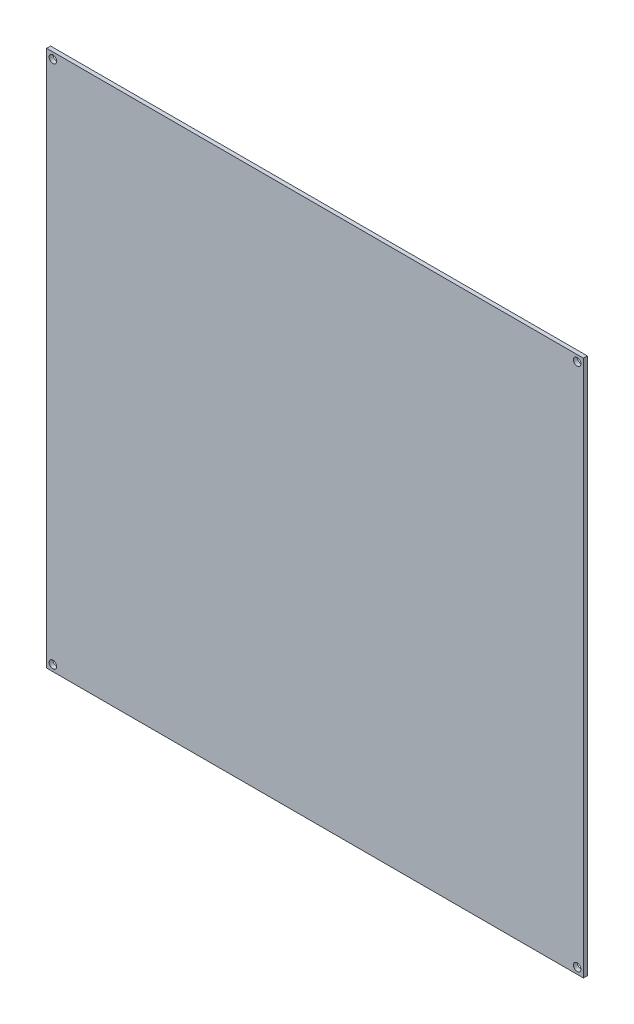
ISO-10303-21;
HEADER;
FILE_DESCRIPTION(('STEP AP214'),'2;1');
FILE_NAME('part.step','',(''),(''),'','','');
FILE_SCHEMA(('AUTOMOTIVE_DESIGN { 1 0 10303 214 1 1 1 1 }'));
ENDSEC;
DATA;
#1=APPLICATION_CONTEXT('core data for automotive mechanical design processes');
#2=APPLICATION_PROTOCOL_DEFINITION('international standard','automotive_design',2000,#1);
#3=PRODUCT_CONTEXT('',#1,'mechanical');
#4=PRODUCT('Part','Part','',(#3));
#5=PRODUCT_RELATED_PRODUCT_CATEGORY('part','',(#4));
#6=PRODUCT_DEFINITION_FORMATION('','',#4);
#7=PRODUCT_DEFINITION_CONTEXT('part definition',#1,'design');
#8=PRODUCT_DEFINITION('design','',#6,#7);
#9=PRODUCT_DEFINITION_SHAPE('','',#8);
#10=(LENGTH_UNIT() NAMED_UNIT(*) SI_UNIT(.MILLI.,.METRE.));
#11=(NAMED_UNIT(*) PLANE_ANGLE_UNIT() SI_UNIT($,.RADIAN.));
#12=(NAMED_UNIT(*) SI_UNIT($,.STERADIAN.) SOLID_ANGLE_UNIT());
#13=UNCERTAINTY_MEASURE_WITH_UNIT(LENGTH_MEASURE(1.E-05),#10,'distance_accuracy_value','');
#14=(GEOMETRIC_REPRESENTATION_CONTEXT(3) GLOBAL_UNCERTAINTY_ASSIGNED_CONTEXT((#13)) GLOBAL_UNIT_ASSIGNED_CONTEXT((#10,
#11,#12)) REPRESENTATION_CONTEXT('',''));
#15=CARTESIAN_POINT('',(0.,0.,0.));
#16=DIRECTION('',(0.,0.,1.));
#17=DIRECTION('',(1.,0.,0.));
#18=AXIS2_PLACEMENT_3D('',#15,#16,#17);
#19=CARTESIAN_POINT('',(0.,0.,1.5748));
#20=DIRECTION('',(0.,0.,1.));
#21=DIRECTION('',(1.,0.,0.));
#22=AXIS2_PLACEMENT_3D('',#19,#20,#21);
#23=PLANE('',#22);
#24=CARTESIAN_POINT('',(104.5,-104.5,1.5748));
#25=DIRECTION('',(0.,0.,1.));
#26=DIRECTION('',(1.,0.,0.));
#27=AXIS2_PLACEMENT_3D('',#24,#25,#26);
#28=CIRCLE('',#27,1.5);
#29=CARTESIAN_POINT('',(106.,-104.5,1.5748));
#30=VERTEX_POINT('',#29);
#31=EDGE_CURVE('E92',#30,#30,#28,.F.);
#32=ORIENTED_EDGE('',*,*,#31,.T.);
#33=EDGE_LOOP('',(#32));
#34=FACE_BOUND('',#33,.T.);
#35=CARTESIAN_POINT('',(-104.5,-104.5,1.5748));
#36=DIRECTION('',(0.,0.,1.));
#37=DIRECTION('',(1.,0.,0.));
#38=AXIS2_PLACEMENT_3D('',#35,#36,#37);
#39=CIRCLE('',#38,1.5);
#40=CARTESIAN_POINT('',(-103.,-104.5,1.5748));
#41=VERTEX_POINT('',#40);
#42=EDGE_CURVE('E95',#41,#41,#39,.F.);
#43=ORIENTED_EDGE('',*,*,#42,.T.);
#44=EDGE_LOOP('',(#43));
#45=FACE_BOUND('',#44,.T.);
#46=CARTESIAN_POINT('',(104.5,104.5,1.5748));
#47=DIRECTION('',(0.,0.,1.));
#48=DIRECTION('',(1.,0.,0.));
#49=AXIS2_PLACEMENT_3D('',#46,#47,#48);
#50=CIRCLE('',#49,1.5);
#51=CARTESIAN_POINT('',(106.,104.5,1.5748));
#52=VERTEX_POINT('',#51);
#53=EDGE_CURVE('E97',#52,#52,#50,.F.);
#54=ORIENTED_EDGE('',*,*,#53,.T.);
#55=EDGE_LOOP('',(#54));
#56=FACE_BOUND('',#55,.T.);
#57=CARTESIAN_POINT('',(-104.5,104.5,1.5748));
#58=DIRECTION('',(0.,0.,1.));
#59=DIRECTION('',(1.,0.,0.));
#60=AXIS2_PLACEMENT_3D('',#57,#58,#59);
#61=CIRCLE('',#60,1.5);
#62=CARTESIAN_POINT('',(-103.,104.5,1.5748));
#63=VERTEX_POINT('',#62);
#64=EDGE_CURVE('E20',#63,#63,#61,.F.);
#65=ORIENTED_EDGE('',*,*,#64,.T.);
#66=EDGE_LOOP('',(#65));
#67=FACE_BOUND('',#66,.T.);
#68=DIRECTION('',(0.,1.,0.));
#69=VECTOR('',#68,1.);
#70=CARTESIAN_POINT('',(-107.,-107.,1.5748));
#71=LINE('',#70,#69);
#72=CARTESIAN_POINT('',(-107.,-107.,1.5748));
#73=VERTEX_POINT('',#72);
#74=CARTESIAN_POINT('',(-107.,107.,1.5748));
#75=VERTEX_POINT('',#74);
#76=EDGE_CURVE('E68',#73,#75,#71,.T.);
#77=ORIENTED_EDGE('',*,*,#76,.F.);
#78=DIRECTION('',(1.,0.,0.));
#79=VECTOR('',#78,1.);
#80=CARTESIAN_POINT('',(107.,-107.,1.5748));
#81=LINE('',#80,#79);
#82=CARTESIAN_POINT('',(107.,-107.,1.5748));
#83=VERTEX_POINT('',#82);
#84=EDGE_CURVE('E59',#83,#73,#81,.F.);
#85=ORIENTED_EDGE('',*,*,#84,.F.);
#86=DIRECTION('',(0.,1.,0.));
#87=VECTOR('',#86,1.);
#88=CARTESIAN_POINT('',(107.,107.,1.5748));
#89=LINE('',#88,#87);
#90=CARTESIAN_POINT('',(107.,107.,1.5748));
#91=VERTEX_POINT('',#90);
#92=EDGE_CURVE('E54',#91,#83,#89,.F.);
#93=ORIENTED_EDGE('',*,*,#92,.F.);
#94=DIRECTION('',(1.,0.,0.));
#95=VECTOR('',#94,1.);
#96=CARTESIAN_POINT('',(-107.,107.,1.5748));
#97=LINE('',#96,#95);
#98=EDGE_CURVE('E71',#75,#91,#97,.T.);
#99=ORIENTED_EDGE('',*,*,#98,.F.);
#100=EDGE_LOOP('',(#77,#85,#93,#99));
#101=FACE_BOUND('',#100,.T.);
#102=ADVANCED_FACE('F17',(#34,#45,#56,#67,#101),#23,.T.);
#103=CARTESIAN_POINT('',(-107.,-107.,0.));
#104=DIRECTION('',(-1.,0.,0.));
#105=DIRECTION('',(0.,0.,1.));
#106=AXIS2_PLACEMENT_3D('',#103,#104,#105);
#107=PLANE('',#106);
#108=DIRECTION('',(0.,1.,0.));
#109=VECTOR('',#108,1.);
#110=CARTESIAN_POINT('',(-107.,0.,0.));
#111=LINE('',#110,#109);
#112=CARTESIAN_POINT('',(-107.,107.,0.));
#113=VERTEX_POINT('',#112);
#114=CARTESIAN_POINT('',(-107.,-107.,0.));
#115=VERTEX_POINT('',#114);
#116=EDGE_CURVE('E78',#113,#115,#111,.F.);
#117=ORIENTED_EDGE('',*,*,#116,.T.);
#118=DIRECTION('',(0.,0.,-1.));
#119=VECTOR('',#118,1.);
#120=CARTESIAN_POINT('',(-107.,-107.,0.));
#121=LINE('',#120,#119);
#122=EDGE_CURVE('E64',#73,#115,#121,.T.);
#123=ORIENTED_EDGE('',*,*,#122,.F.);
#124=ORIENTED_EDGE('',*,*,#76,.T.);
#125=DIRECTION('',(0.,0.,1.));
#126=VECTOR('',#125,1.);
#127=CARTESIAN_POINT('',(-107.,107.,0.));
#128=LINE('',#127,#126);
#129=EDGE_CURVE('E102',#113,#75,#128,.T.);
#130=ORIENTED_EDGE('',*,*,#129,.F.);
#131=EDGE_LOOP('',(#117,#123,#124,#130));
#132=FACE_BOUND('',#131,.T.);
#133=ADVANCED_FACE('F77',(#132),#107,.T.);
#134=CARTESIAN_POINT('',(107.,-107.,0.));
#135=DIRECTION('',(0.,-1.,0.));
#136=DIRECTION('',(0.,0.,-1.));
#137=AXIS2_PLACEMENT_3D('',#134,#135,#136);
#138=PLANE('',#137);
#139=DIRECTION('',(1.,0.,0.));
#140=VECTOR('',#139,1.);
#141=CARTESIAN_POINT('',(0.,-107.,0.));
#142=LINE('',#141,#140);
#143=CARTESIAN_POINT('',(107.,-107.,0.));
#144=VERTEX_POINT('',#143);
#145=EDGE_CURVE('E116',#115,#144,#142,.T.);
#146=ORIENTED_EDGE('',*,*,#145,.T.);
#147=DIRECTION('',(0.,0.,-1.));
#148=VECTOR('',#147,1.);
#149=CARTESIAN_POINT('',(107.,-107.,0.));
#150=LINE('',#149,#148);
#151=EDGE_CURVE('E66',#83,#144,#150,.T.);
#152=ORIENTED_EDGE('',*,*,#151,.F.);
#153=ORIENTED_EDGE('',*,*,#84,.T.);
#154=ORIENTED_EDGE('',*,*,#122,.T.);
#155=EDGE_LOOP('',(#146,#152,#153,#154));
#156=FACE_BOUND('',#155,.T.);
#157=ADVANCED_FACE('F62',(#156),#138,.T.);
#158=CARTESIAN_POINT('',(107.,107.,0.));
#159=DIRECTION('',(1.,0.,0.));
#160=DIRECTION('',(0.,0.,-1.));
#161=AXIS2_PLACEMENT_3D('',#158,#159,#160);
#162=PLANE('',#161);
#163=DIRECTION('',(0.,1.,0.));
#164=VECTOR('',#163,1.);
#165=CARTESIAN_POINT('',(107.,0.,0.));
#166=LINE('',#165,#164);
#167=CARTESIAN_POINT('',(107.,107.,0.));
#168=VERTEX_POINT('',#167);
#169=EDGE_CURVE('E113',#144,#168,#166,.T.);
#170=ORIENTED_EDGE('',*,*,#169,.T.);
#171=DIRECTION('',(0.,0.,1.));
#172=VECTOR('',#171,1.);
#173=CARTESIAN_POINT('',(107.,107.,0.));
#174=LINE('',#173,#172);
#175=EDGE_CURVE('E35',#91,#168,#174,.F.);
#176=ORIENTED_EDGE('',*,*,#175,.F.);
#177=ORIENTED_EDGE('',*,*,#92,.T.);
#178=ORIENTED_EDGE('',*,*,#151,.T.);
#179=EDGE_LOOP('',(#170,#176,#177,#178));
#180=FACE_BOUND('',#179,.T.);
#181=ADVANCED_FACE('F112',(#180),#162,.T.);
#182=CARTESIAN_POINT('',(-107.,107.,0.));
#183=DIRECTION('',(0.,1.,0.));
#184=DIRECTION('',(0.,0.,1.));
#185=AXIS2_PLACEMENT_3D('',#182,#183,#184);
#186=PLANE('',#185);
#187=DIRECTION('',(1.,0.,0.));
#188=VECTOR('',#187,1.);
#189=CARTESIAN_POINT('',(0.,107.,0.));
#190=LINE('',#189,#188);
#191=EDGE_CURVE('E91',#168,#113,#190,.F.);
#192=ORIENTED_EDGE('',*,*,#191,.T.);
#193=ORIENTED_EDGE('',*,*,#129,.T.);
#194=ORIENTED_EDGE('',*,*,#98,.T.);
#195=ORIENTED_EDGE('',*,*,#175,.T.);
#196=EDGE_LOOP('',(#192,#193,#194,#195));
#197=FACE_BOUND('',#196,.T.);
#198=ADVANCED_FACE('F119',(#197),#186,.T.);
#199=CARTESIAN_POINT('',(-104.5,104.5,0.));
#200=DIRECTION('',(0.,0.,1.));
#201=DIRECTION('',(1.,0.,0.));
#202=AXIS2_PLACEMENT_3D('',#199,#200,#201);
#203=CYLINDRICAL_SURFACE('',#202,1.5);
#204=CARTESIAN_POINT('',(-104.5,104.5,0.));
#205=DIRECTION('',(0.,0.,1.));
#206=DIRECTION('',(1.,0.,0.));
#207=AXIS2_PLACEMENT_3D('',#204,#205,#206);
#208=CIRCLE('',#207,1.5);
#209=CARTESIAN_POINT('',(-103.,104.5,0.));
#210=VERTEX_POINT('',#209);
#211=EDGE_CURVE('E88',#210,#210,#208,.F.);
#212=ORIENTED_EDGE('',*,*,#211,.T.);
#213=EDGE_LOOP('',(#212));
#214=FACE_BOUND('',#213,.T.);
#215=ORIENTED_EDGE('',*,*,#64,.F.);
#216=EDGE_LOOP('',(#215));
#217=FACE_BOUND('',#216,.T.);
#218=ADVANCED_FACE('F121',(#214,#217),#203,.F.);
#219=CARTESIAN_POINT('',(104.5,104.5,0.));
#220=DIRECTION('',(0.,0.,1.));
#221=DIRECTION('',(1.,0.,0.));
#222=AXIS2_PLACEMENT_3D('',#219,#220,#221);
#223=CYLINDRICAL_SURFACE('',#222,1.5);
#224=CARTESIAN_POINT('',(104.5,104.5,0.));
#225=DIRECTION('',(0.,0.,1.));
#226=DIRECTION('',(1.,0.,0.));
#227=AXIS2_PLACEMENT_3D('',#224,#225,#226);
#228=CIRCLE('',#227,1.5);
#229=CARTESIAN_POINT('',(106.,104.5,0.));
#230=VERTEX_POINT('',#229);
#231=EDGE_CURVE('E85',#230,#230,#228,.F.);
#232=ORIENTED_EDGE('',*,*,#231,.T.);
#233=EDGE_LOOP('',(#232));
#234=FACE_BOUND('',#233,.T.);
#235=ORIENTED_EDGE('',*,*,#53,.F.);
#236=EDGE_LOOP('',(#235));
#237=FACE_BOUND('',#236,.T.);
#238=ADVANCED_FACE('F129',(#234,#237),#223,.F.);
#239=CARTESIAN_POINT('',(-104.5,-104.5,0.));
#240=DIRECTION('',(0.,0.,1.));
#241=DIRECTION('',(1.,0.,0.));
#242=AXIS2_PLACEMENT_3D('',#239,#240,#241);
#243=CYLINDRICAL_SURFACE('',#242,1.5);
#244=CARTESIAN_POINT('',(-104.5,-104.5,0.));
#245=DIRECTION('',(0.,0.,1.));
#246=DIRECTION('',(1.,0.,0.));
#247=AXIS2_PLACEMENT_3D('',#244,#245,#246);
#248=CIRCLE('',#247,1.5);
#249=CARTESIAN_POINT('',(-103.,-104.5,0.));
#250=VERTEX_POINT('',#249);
#251=EDGE_CURVE('E26',#250,#250,#248,.F.);
#252=ORIENTED_EDGE('',*,*,#251,.T.);
#253=EDGE_LOOP('',(#252));
#254=FACE_BOUND('',#253,.T.);
#255=ORIENTED_EDGE('',*,*,#42,.F.);
#256=EDGE_LOOP('',(#255));
#257=FACE_BOUND('',#256,.T.);
#258=ADVANCED_FACE('F141',(#254,#257),#243,.F.);
#259=CARTESIAN_POINT('',(104.5,-104.5,0.));
#260=DIRECTION('',(0.,0.,1.));
#261=DIRECTION('',(1.,0.,0.));
#262=AXIS2_PLACEMENT_3D('',#259,#260,#261);
#263=CYLINDRICAL_SURFACE('',#262,1.5);
#264=CARTESIAN_POINT('',(104.5,-104.5,0.));
#265=DIRECTION('',(0.,0.,1.));
#266=DIRECTION('',(1.,0.,0.));
#267=AXIS2_PLACEMENT_3D('',#264,#265,#266);
#268=CIRCLE('',#267,1.5);
#269=CARTESIAN_POINT('',(106.,-104.5,0.));
#270=VERTEX_POINT('',#269);
#271=EDGE_CURVE('E11',#270,#270,#268,.F.);
#272=ORIENTED_EDGE('',*,*,#271,.T.);
#273=EDGE_LOOP('',(#272));
#274=FACE_BOUND('',#273,.T.);
#275=ORIENTED_EDGE('',*,*,#31,.F.);
#276=EDGE_LOOP('',(#275));
#277=FACE_BOUND('',#276,.T.);
#278=ADVANCED_FACE('F134',(#274,#277),#263,.F.);
#279=CARTESIAN_POINT('',(0.,0.,0.));
#280=DIRECTION('',(0.,0.,1.));
#281=DIRECTION('',(1.,0.,0.));
#282=AXIS2_PLACEMENT_3D('',#279,#280,#281);
#283=PLANE('',#282);
#284=ORIENTED_EDGE('',*,*,#271,.F.);
#285=EDGE_LOOP('',(#284));
#286=FACE_BOUND('',#285,.T.);
#287=ORIENTED_EDGE('',*,*,#251,.F.);
#288=EDGE_LOOP('',(#287));
#289=FACE_BOUND('',#288,.T.);
#290=ORIENTED_EDGE('',*,*,#231,.F.);
#291=EDGE_LOOP('',(#290));
#292=FACE_BOUND('',#291,.T.);
#293=ORIENTED_EDGE('',*,*,#211,.F.);
#294=EDGE_LOOP('',(#293));
#295=FACE_BOUND('',#294,.T.);
#296=ORIENTED_EDGE('',*,*,#169,.F.);
#297=ORIENTED_EDGE('',*,*,#145,.F.);
#298=ORIENTED_EDGE('',*,*,#116,.F.);
#299=ORIENTED_EDGE('',*,*,#191,.F.);
#300=EDGE_LOOP('',(#296,#297,#298,#299));
#301=FACE_BOUND('',#300,.T.);
#302=ADVANCED_FACE('F115',(#286,#289,#292,#295,#301),#283,.F.);
#303=CLOSED_SHELL('',(#102,#133,#157,#181,#198,#218,#238,#258,#278,#302));
#304=MANIFOLD_SOLID_BREP('B1',#303);
#305=ADVANCED_BREP_SHAPE_REPRESENTATION('',(#18,#304),#14);
#306=SHAPE_DEFINITION_REPRESENTATION(#9,#305);
ENDSEC;
END-ISO-10303-21;
